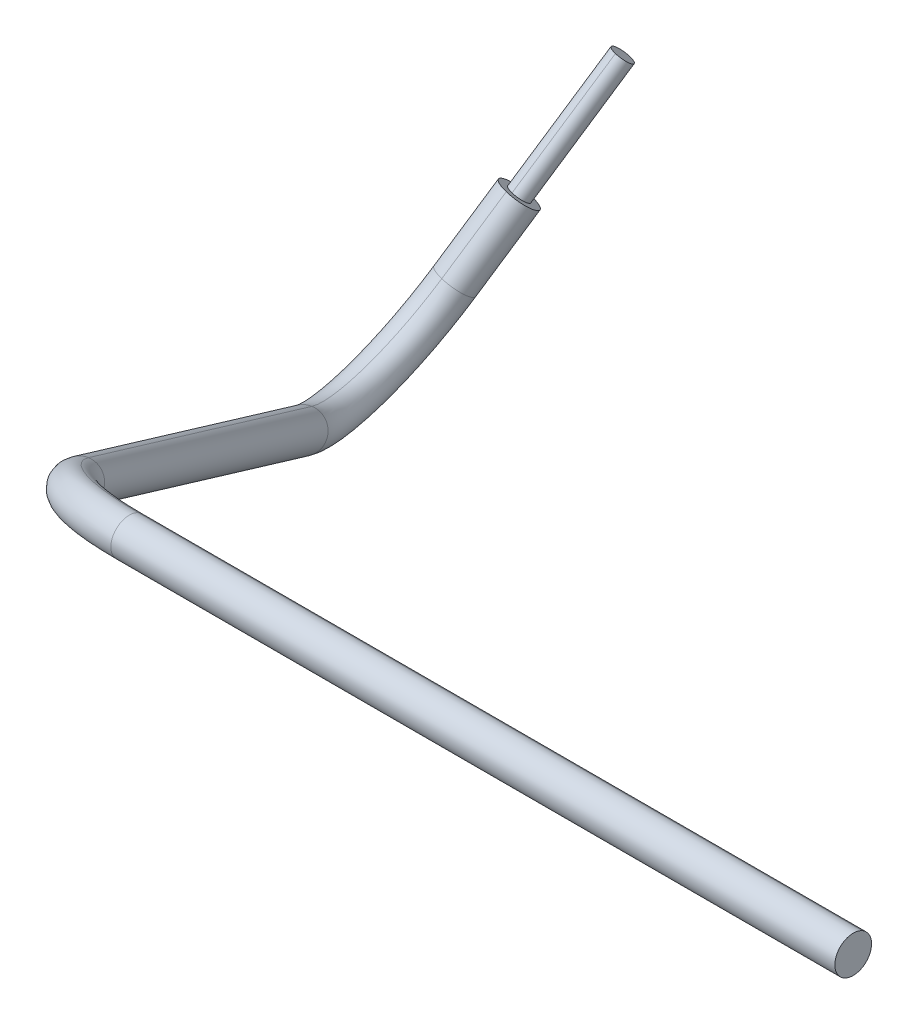
ISO-10303-21;
HEADER;
FILE_DESCRIPTION(('STEP AP214'),'2;1');
FILE_NAME('part.step','',(''),(''),'','','');
FILE_SCHEMA(('AUTOMOTIVE_DESIGN { 1 0 10303 214 1 1 1 1 }'));
ENDSEC;
DATA;
#1=APPLICATION_CONTEXT('core data for automotive mechanical design processes');
#2=APPLICATION_PROTOCOL_DEFINITION('international standard','automotive_design',2000,#1);
#3=PRODUCT_CONTEXT('',#1,'mechanical');
#4=PRODUCT('Part','Part','',(#3));
#5=PRODUCT_RELATED_PRODUCT_CATEGORY('part','',(#4));
#6=PRODUCT_DEFINITION_FORMATION('','',#4);
#7=PRODUCT_DEFINITION_CONTEXT('part definition',#1,'design');
#8=PRODUCT_DEFINITION('design','',#6,#7);
#9=PRODUCT_DEFINITION_SHAPE('','',#8);
#10=(LENGTH_UNIT() NAMED_UNIT(*) SI_UNIT(.MILLI.,.METRE.));
#11=(NAMED_UNIT(*) PLANE_ANGLE_UNIT() SI_UNIT($,.RADIAN.));
#12=(NAMED_UNIT(*) SI_UNIT($,.STERADIAN.) SOLID_ANGLE_UNIT());
#13=UNCERTAINTY_MEASURE_WITH_UNIT(LENGTH_MEASURE(1.E-05),#10,'distance_accuracy_value','');
#14=(GEOMETRIC_REPRESENTATION_CONTEXT(3) GLOBAL_UNCERTAINTY_ASSIGNED_CONTEXT((#13)) GLOBAL_UNIT_ASSIGNED_CONTEXT((#10,
#11,#12)) REPRESENTATION_CONTEXT('',''));
#15=CARTESIAN_POINT('',(0.,0.,0.));
#16=DIRECTION('',(0.,0.,1.));
#17=DIRECTION('',(1.,0.,0.));
#18=AXIS2_PLACEMENT_3D('',#15,#16,#17);
#19=CARTESIAN_POINT('',(-140.4669149487,-33.8291598666141,-101.131028985723));
#20=DIRECTION('',(0.230950995144067,0.776274779797275,-0.586565515601332));
#21=DIRECTION('',(-0.97256588869086,0.20146139609418,-0.116313791266306));
#22=AXIS2_PLACEMENT_3D('',#19,#20,#21);
#23=CYLINDRICAL_SURFACE('',#22,0.5);
#24=DIRECTION('',(-0.230950995144067,-0.776274779797275,0.586565515601332));
#25=VECTOR('',#24,1.);
#26=CARTESIAN_POINT('',(-140.5180856365,-34.1192287287071,-101.535060687362));
#27=LINE('',#26,#25);
#28=CARTESIAN_POINT('',(-139.8021375516,-31.7127769113196,-103.35341378568));
#29=VERTEX_POINT('',#28);
#30=CARTESIAN_POINT('',(-141.2340337215,-36.525680546088,-99.7167075889324));
#31=VERTEX_POINT('',#30);
#32=EDGE_CURVE('E11',#29,#31,#27,.T.);
#33=ORIENTED_EDGE('',*,*,#32,.T.);
#34=CARTESIAN_POINT('',(-141.1828630336,-36.235611683943,-99.3126758873235));
#35=DIRECTION('',(0.230950995144067,0.776274779797275,-0.586565515601332));
#36=DIRECTION('',(-0.857039245995224,0.447698345336645,0.255048862782739));
#37=AXIS2_PLACEMENT_3D('',#34,#35,#36);
#38=CIRCLE('',#37,0.5);
#39=CARTESIAN_POINT('',(-141.1316923457,-35.945542821798,-98.9086441857147));
#40=VERTEX_POINT('',#39);
#41=EDGE_CURVE('E27',#31,#40,#38,.T.);
#42=ORIENTED_EDGE('',*,*,#41,.T.);
#43=DIRECTION('',(-0.230950995144067,-0.776274779797275,0.586565515601332));
#44=VECTOR('',#43,1.);
#45=CARTESIAN_POINT('',(-140.4157442608,-33.5390910044345,-100.726997284135));
#46=LINE('',#45,#44);
#47=CARTESIAN_POINT('',(-139.6997961758,-31.132639187047,-102.545350382453));
#48=VERTEX_POINT('',#47);
#49=EDGE_CURVE('E180',#48,#40,#46,.T.);
#50=ORIENTED_EDGE('',*,*,#49,.F.);
#51=CARTESIAN_POINT('',(-139.7509668637,-31.4227080492266,-102.949382084042));
#52=DIRECTION('',(0.230950995144067,0.776274779797275,-0.586565515601332));
#53=DIRECTION('',(-0.857039245995224,0.447698345336645,0.255048862782739));
#54=AXIS2_PLACEMENT_3D('',#51,#52,#53);
#55=CIRCLE('',#54,0.5);
#56=EDGE_CURVE('E176',#29,#48,#55,.T.);
#57=ORIENTED_EDGE('',*,*,#56,.F.);
#58=EDGE_LOOP('',(#33,#42,#50,#57));
#59=FACE_BOUND('',#58,.T.);
#60=ADVANCED_FACE('F17',(#59),#23,.T.);
#61=CARTESIAN_POINT('',(-140.4669149487,-33.8291598666141,-101.131028985723));
#62=DIRECTION('',(0.230950995144067,0.776274779797275,-0.586565515601332));
#63=DIRECTION('',(-0.97256588869086,0.20146139609418,-0.116313791266306));
#64=AXIS2_PLACEMENT_3D('',#61,#62,#63);
#65=CYLINDRICAL_SURFACE('',#64,0.5);
#66=ORIENTED_EDGE('',*,*,#49,.T.);
#67=CARTESIAN_POINT('',(-141.1828630336,-36.235611683943,-99.3126758873235));
#68=DIRECTION('',(0.230950995144067,0.776274779797275,-0.586565515601332));
#69=DIRECTION('',(-0.857039245995224,0.447698345336645,0.255048862782739));
#70=AXIS2_PLACEMENT_3D('',#67,#68,#69);
#71=CIRCLE('',#70,0.5);
#72=EDGE_CURVE('E177',#40,#31,#71,.T.);
#73=ORIENTED_EDGE('',*,*,#72,.T.);
#74=ORIENTED_EDGE('',*,*,#32,.F.);
#75=CARTESIAN_POINT('',(-139.7509668637,-31.4227080492266,-102.949382084042));
#76=DIRECTION('',(0.230950995144067,0.776274779797275,-0.586565515601332));
#77=DIRECTION('',(-0.857039245995224,0.447698345336645,0.255048862782739));
#78=AXIS2_PLACEMENT_3D('',#75,#76,#77);
#79=CIRCLE('',#78,0.5);
#80=EDGE_CURVE('E173',#48,#29,#79,.T.);
#81=ORIENTED_EDGE('',*,*,#80,.F.);
#82=EDGE_LOOP('',(#66,#73,#74,#81));
#83=FACE_BOUND('',#82,.T.);
#84=ADVANCED_FACE('F190',(#83),#65,.T.);
#85=CARTESIAN_POINT('',(-88.0553859815001,-20.1443490061517,-67.6690067781521));
#86=DIRECTION('',(0.230950995144067,0.776274779797275,-0.586565515601332));
#87=DIRECTION('',(1.71982005971951E-13,0.60286370454622,0.797844191393789));
#88=AXIS2_PLACEMENT_3D('',#85,#86,#87);
#89=PLANE('',#88);
#90=ORIENTED_EDGE('',*,*,#56,.T.);
#91=ORIENTED_EDGE('',*,*,#80,.T.);
#92=EDGE_LOOP('',(#90,#91));
#93=FACE_BOUND('',#92,.T.);
#94=ADVANCED_FACE('F192',(#93),#89,.T.);
#95=CARTESIAN_POINT('',(-141.1828630336,-36.235611683943,-99.3126758873235));
#96=DIRECTION('',(0.230950995144067,0.776274779797275,-0.586565515601332));
#97=DIRECTION('',(-0.102341375739045,-0.580137724304706,-0.80806340323665));
#98=AXIS2_PLACEMENT_3D('',#95,#96,#97);
#99=PLANE('',#98);
#100=CARTESIAN_POINT('',(-141.1828630336,-36.235611683943,-99.3126758873235));
#101=DIRECTION('',(0.230950995144067,0.776274779797275,-0.586565515601332));
#102=DIRECTION('',(-0.857039245995226,0.447698345336643,0.255048862782736));
#103=AXIS2_PLACEMENT_3D('',#100,#101,#102);
#104=CIRCLE('',#103,0.9);
#105=CARTESIAN_POINT('',(-141.0907557954,-35.7134877320703,-98.5854188244113));
#106=VERTEX_POINT('',#105);
#107=CARTESIAN_POINT('',(-141.2749702718,-36.7577356358158,-100.039932950236));
#108=VERTEX_POINT('',#107);
#109=EDGE_CURVE('E143',#106,#108,#104,.T.);
#110=ORIENTED_EDGE('',*,*,#109,.T.);
#111=CARTESIAN_POINT('',(-141.1828630336,-36.235611683943,-99.3126758873235));
#112=DIRECTION('',(0.230950995144067,0.776274779797275,-0.586565515601332));
#113=DIRECTION('',(-0.857039245995226,0.447698345336643,0.255048862782736));
#114=AXIS2_PLACEMENT_3D('',#111,#112,#113);
#115=CIRCLE('',#114,0.9);
#116=EDGE_CURVE('E169',#108,#106,#115,.T.);
#117=ORIENTED_EDGE('',*,*,#116,.T.);
#118=EDGE_LOOP('',(#110,#117));
#119=FACE_BOUND('',#118,.T.);
#120=ORIENTED_EDGE('',*,*,#41,.F.);
#121=ORIENTED_EDGE('',*,*,#72,.F.);
#122=EDGE_LOOP('',(#120,#121));
#123=FACE_BOUND('',#122,.T.);
#124=ADVANCED_FACE('F188',(#119,#123),#99,.T.);
#125=CARTESIAN_POINT('',(-104.25,-25.,-64.));
#126=DIRECTION('',(-1.,0.,0.));
#127=DIRECTION('',(0.,-0.866025403784435,0.5));
#128=AXIS2_PLACEMENT_3D('',#125,#126,#127);
#129=CYLINDRICAL_SURFACE('',#128,0.9);
#130=DIRECTION('',(-1.,0.,0.));
#131=VECTOR('',#130,1.);
#132=CARTESIAN_POINT('',(-107.24423619,-24.2205771365941,-64.45));
#133=LINE('',#132,#131);
#134=CARTESIAN_POINT('',(-89.5,-24.2205771365941,-64.45));
#135=VERTEX_POINT('',#134);
#136=CARTESIAN_POINT('',(-119.,-24.2205771365941,-64.45));
#137=VERTEX_POINT('',#136);
#138=EDGE_CURVE('E149',#135,#137,#133,.T.);
#139=ORIENTED_EDGE('',*,*,#138,.F.);
#140=CARTESIAN_POINT('',(-89.5,-25.,-64.));
#141=DIRECTION('',(-1.,0.,0.));
#142=DIRECTION('',(0.,0.866025403784436,-0.500000000000006));
#143=AXIS2_PLACEMENT_3D('',#140,#141,#142);
#144=CIRCLE('',#143,0.9);
#145=CARTESIAN_POINT('',(-89.5,-25.7794228634061,-63.55));
#146=VERTEX_POINT('',#145);
#147=EDGE_CURVE('E165',#135,#146,#144,.T.);
#148=ORIENTED_EDGE('',*,*,#147,.T.);
#149=DIRECTION('',(1.,0.,0.));
#150=VECTOR('',#149,1.);
#151=CARTESIAN_POINT('',(-107.24423619,-25.7794228634061,-63.55));
#152=LINE('',#151,#150);
#153=CARTESIAN_POINT('',(-119.,-25.7794228634061,-63.55));
#154=VERTEX_POINT('',#153);
#155=EDGE_CURVE('E158',#154,#146,#152,.T.);
#156=ORIENTED_EDGE('',*,*,#155,.F.);
#157=DIRECTION('',(-1.,0.,0.));
#158=VECTOR('',#157,1.);
#159=CARTESIAN_POINT('',(-107.24423619,-25.7794228634061,-63.55));
#160=LINE('',#159,#158);
#161=CARTESIAN_POINT('',(-124.98847238,-25.7794228634061,-63.55));
#162=VERTEX_POINT('',#161);
#163=EDGE_CURVE('E161',#154,#162,#160,.T.);
#164=ORIENTED_EDGE('',*,*,#163,.T.);
#165=CARTESIAN_POINT('',(-124.98847238,-25.,-64.));
#166=DIRECTION('',(-1.,0.,0.));
#167=DIRECTION('',(0.,0.866025403784436,-0.500000000000006));
#168=AXIS2_PLACEMENT_3D('',#165,#166,#167);
#169=CIRCLE('',#168,0.9);
#170=CARTESIAN_POINT('',(-124.98847238,-24.2205771365941,-64.45));
#171=VERTEX_POINT('',#170);
#172=EDGE_CURVE('E118',#171,#162,#169,.T.);
#173=ORIENTED_EDGE('',*,*,#172,.F.);
#174=DIRECTION('',(1.,0.,0.));
#175=VECTOR('',#174,1.);
#176=CARTESIAN_POINT('',(-107.24423619,-24.2205771365941,-64.45));
#177=LINE('',#176,#175);
#178=EDGE_CURVE('E159',#171,#137,#177,.T.);
#179=ORIENTED_EDGE('',*,*,#178,.T.);
#180=EDGE_LOOP('',(#139,#148,#156,#164,#173,#179));
#181=FACE_BOUND('',#180,.T.);
#182=ADVANCED_FACE('F200',(#181),#129,.T.);
#183=CARTESIAN_POINT('',(-104.25,-25.,-64.));
#184=DIRECTION('',(-1.,0.,0.));
#185=DIRECTION('',(0.,-0.866025403784435,0.5));
#186=AXIS2_PLACEMENT_3D('',#183,#184,#185);
#187=CYLINDRICAL_SURFACE('',#186,0.9);
#188=ORIENTED_EDGE('',*,*,#155,.T.);
#189=CARTESIAN_POINT('',(-89.5,-25.,-64.));
#190=DIRECTION('',(-1.,0.,0.));
#191=DIRECTION('',(0.,0.866025403784436,-0.500000000000006));
#192=AXIS2_PLACEMENT_3D('',#189,#190,#191);
#193=CIRCLE('',#192,0.9);
#194=EDGE_CURVE('E155',#146,#135,#193,.T.);
#195=ORIENTED_EDGE('',*,*,#194,.T.);
#196=ORIENTED_EDGE('',*,*,#138,.T.);
#197=ORIENTED_EDGE('',*,*,#178,.F.);
#198=CARTESIAN_POINT('',(-124.98847238,-25.,-64.));
#199=DIRECTION('',(-1.,0.,0.));
#200=DIRECTION('',(0.,0.866025403784436,-0.500000000000006));
#201=AXIS2_PLACEMENT_3D('',#198,#199,#200);
#202=CIRCLE('',#201,0.9);
#203=EDGE_CURVE('E97',#162,#171,#202,.T.);
#204=ORIENTED_EDGE('',*,*,#203,.F.);
#205=ORIENTED_EDGE('',*,*,#163,.F.);
#206=EDGE_LOOP('',(#188,#195,#196,#197,#204,#205));
#207=FACE_BOUND('',#206,.T.);
#208=ADVANCED_FACE('F239',(#207),#187,.T.);
#209=CARTESIAN_POINT('',(-89.5,-25.,-64.));
#210=DIRECTION('',(-1.,0.,0.));
#211=DIRECTION('',(0.,-0.866025403784439,0.5));
#212=AXIS2_PLACEMENT_3D('',#209,#210,#211);
#213=PLANE('',#212);
#214=ORIENTED_EDGE('',*,*,#194,.F.);
#215=ORIENTED_EDGE('',*,*,#147,.F.);
#216=EDGE_LOOP('',(#214,#215));
#217=FACE_BOUND('',#216,.T.);
#218=ADVANCED_FACE('F250',(#217),#213,.F.);
#219=CARTESIAN_POINT('',(-141.629573538,-37.7370994702294,-98.1781279406356));
#220=DIRECTION('',(0.230950995144067,0.776274779797275,-0.586565515601332));
#221=DIRECTION('',(-0.97256588869086,0.201461396094187,-0.116313791266296));
#222=AXIS2_PLACEMENT_3D('',#219,#220,#221);
#223=CYLINDRICAL_SURFACE('',#222,0.9);
#224=DIRECTION('',(-0.230950995144067,-0.776274779797275,0.586565515601332));
#225=VECTOR('',#224,1.);
#226=CARTESIAN_POINT('',(-141.7216807762,-38.2592234221022,-98.9053850035478));
#227=LINE('',#226,#225);
#228=CARTESIAN_POINT('',(-142.1683912806,-39.7607112083299,-97.7708370567784));
#229=VERTEX_POINT('',#228);
#230=EDGE_CURVE('E147',#108,#229,#227,.T.);
#231=ORIENTED_EDGE('',*,*,#230,.T.);
#232=CARTESIAN_POINT('',(-142.0762840424,-39.2385872564571,-97.0435799938661));
#233=DIRECTION('',(0.230950995144067,0.776274779797275,-0.586565515601332));
#234=DIRECTION('',(-0.857039245995226,0.447698345336643,0.255048862782736));
#235=AXIS2_PLACEMENT_3D('',#232,#233,#234);
#236=CIRCLE('',#235,0.9);
#237=CARTESIAN_POINT('',(-141.9841768042,-38.7164633045844,-96.3163229309539));
#238=VERTEX_POINT('',#237);
#239=EDGE_CURVE('E134',#229,#238,#236,.T.);
#240=ORIENTED_EDGE('',*,*,#239,.T.);
#241=DIRECTION('',(-0.230950995144067,-0.776274779797275,0.586565515601332));
#242=VECTOR('',#241,1.);
#243=CARTESIAN_POINT('',(-141.5374662998,-37.214975518348,-97.4508708777284));
#244=LINE('',#243,#242);
#245=EDGE_CURVE('E99',#106,#238,#244,.T.);
#246=ORIENTED_EDGE('',*,*,#245,.F.);
#247=ORIENTED_EDGE('',*,*,#116,.F.);
#248=EDGE_LOOP('',(#231,#240,#246,#247));
#249=FACE_BOUND('',#248,.T.);
#250=ADVANCED_FACE('F146',(#249),#223,.T.);
#251=CARTESIAN_POINT('',(-139.8128380185,-36.3330133901466,-92.307077845292));
#252=DIRECTION('',(-0.896856099246292,0.403593211462475,0.181001814648727));
#253=DIRECTION('',(0.377241003984007,0.484262311058509,0.789417024772972));
#254=AXIS2_PLACEMENT_3D('',#251,#252,#253);
#255=TOROIDAL_SURFACE('',#254,6.,0.9);
#256=CARTESIAN_POINT('',(-141.1491337817,-40.9265574532114,-88.6857981579666));
#257=DIRECTION('',(-0.382160618280918,-0.500982469429405,-0.776511318114271));
#258=DIRECTION('',(-0.0174476937738369,0.844054959868547,-0.535972763023719));
#259=AXIS2_PLACEMENT_3D('',#256,#257,#258);
#260=CIRCLE('',#259,0.9);
#261=CARTESIAN_POINT('',(-141.108086684,-41.6911022510084,-88.2127374980735));
#262=VERTEX_POINT('',#261);
#263=CARTESIAN_POINT('',(-141.1901808794,-40.1620126554153,-89.1588588178593));
#264=VERTEX_POINT('',#263);
#265=EDGE_CURVE('E136',#262,#264,#260,.T.);
#266=ORIENTED_EDGE('',*,*,#265,.T.);
#267=CARTESIAN_POINT('',(-140.045799612,-36.2281786035971,-92.2600619736475));
#268=DIRECTION('',(-0.896856099246292,0.403593211462475,0.181001814648727));
#269=DIRECTION('',(0.240512927451466,0.788392787197326,-0.566206980550361));
#270=AXIS2_PLACEMENT_3D('',#267,#268,#269);
#271=CIRCLE('',#270,5.13829931456);
#272=EDGE_CURVE('E116',#238,#264,#271,.T.);
#273=ORIENTED_EDGE('',*,*,#272,.F.);
#274=ORIENTED_EDGE('',*,*,#239,.F.);
#275=CARTESIAN_POINT('',(-139.5798764249,-36.4378481766376,-92.3540937168549));
#276=DIRECTION('',(-0.896856099246292,0.403593211462475,0.181001814648727));
#277=DIRECTION('',(0.240512927451467,0.788392787197327,-0.56620698055036));
#278=AXIS2_PLACEMENT_3D('',#275,#276,#277);
#279=CIRCLE('',#278,6.86170068544);
#280=EDGE_CURVE('E114',#229,#262,#279,.T.);
#281=ORIENTED_EDGE('',*,*,#280,.T.);
#282=EDGE_LOOP('',(#266,#273,#274,#281));
#283=FACE_BOUND('',#282,.T.);
#284=ADVANCED_FACE('F132',(#283),#255,.T.);
#285=CARTESIAN_POINT('',(-135.8410908286,-33.9681312332553,-77.9003973789533));
#286=DIRECTION('',(-0.382160618280918,-0.500982469429405,-0.776511318114271));
#287=DIRECTION('',(0.923931187814937,-0.191279350808496,-0.331305554039107));
#288=AXIS2_PLACEMENT_3D('',#285,#286,#287);
#289=CYLINDRICAL_SURFACE('',#288,0.9);
#290=CARTESIAN_POINT('',(-130.5330478755,-27.0097050132711,-67.114996599887));
#291=DIRECTION('',(-0.382160618280918,-0.500982469429405,-0.776511318114271));
#292=DIRECTION('',(-0.0174476937738375,0.844054959868547,-0.535972763023719));
#293=AXIS2_PLACEMENT_3D('',#290,#291,#292);
#294=CIRCLE('',#293,0.9);
#295=CARTESIAN_POINT('',(-130.4920007778,-27.7742498110714,-66.6419359400035));
#296=VERTEX_POINT('',#295);
#297=CARTESIAN_POINT('',(-130.5740949732,-26.2451602154767,-67.5880572597787));
#298=VERTEX_POINT('',#297);
#299=EDGE_CURVE('E94',#296,#298,#294,.T.);
#300=ORIENTED_EDGE('',*,*,#299,.T.);
#301=DIRECTION('',(-0.382160618280918,-0.500982469429405,-0.776511318114271));
#302=VECTOR('',#301,1.);
#303=CARTESIAN_POINT('',(-135.8821379263,-33.2035864354611,-78.3734580388448));
#304=LINE('',#303,#302);
#305=EDGE_CURVE('E104',#298,#264,#304,.T.);
#306=ORIENTED_EDGE('',*,*,#305,.T.);
#307=ORIENTED_EDGE('',*,*,#265,.F.);
#308=DIRECTION('',(-0.382160618280918,-0.500982469429405,-0.776511318114271));
#309=VECTOR('',#308,1.);
#310=CARTESIAN_POINT('',(-135.8000437309,-34.7326760310481,-77.4273367190627));
#311=LINE('',#310,#309);
#312=EDGE_CURVE('E113',#296,#262,#311,.T.);
#313=ORIENTED_EDGE('',*,*,#312,.F.);
#314=EDGE_LOOP('',(#300,#306,#307,#313));
#315=FACE_BOUND('',#314,.T.);
#316=ADVANCED_FACE('F112',(#315),#289,.T.);
#317=CARTESIAN_POINT('',(-124.98847238,-28.2527952615817,-69.0417579261864));
#318=DIRECTION('',(0.,0.840292987697383,-0.542132543596681));
#319=DIRECTION('',(0.924095915928318,-0.207181708050937,-0.321126887715277));
#320=AXIS2_PLACEMENT_3D('',#317,#318,#319);
#321=TOROIDAL_SURFACE('',#320,6.,0.9);
#322=ORIENTED_EDGE('',*,*,#203,.T.);
#323=CARTESIAN_POINT('',(-124.98847238,-27.4974531966001,-69.5290826105162));
#324=DIRECTION('',(0.,-0.840292987697383,0.542132543596681));
#325=DIRECTION('',(0.,0.542132543596681,0.840292987697383));
#326=AXIS2_PLACEMENT_3D('',#323,#324,#325);
#327=CIRCLE('',#326,6.04441865501);
#328=EDGE_CURVE('E90',#171,#298,#327,.T.);
#329=ORIENTED_EDGE('',*,*,#328,.T.);
#330=ORIENTED_EDGE('',*,*,#299,.F.);
#331=CARTESIAN_POINT('',(-124.98847238,-29.0081373265616,-68.5544332418576));
#332=DIRECTION('',(0.,-0.840292987697383,0.542132543596681));
#333=DIRECTION('',(0.,0.542132543596681,0.840292987697383));
#334=AXIS2_PLACEMENT_3D('',#331,#332,#333);
#335=CIRCLE('',#334,5.95558134499);
#336=EDGE_CURVE('E83',#162,#296,#335,.T.);
#337=ORIENTED_EDGE('',*,*,#336,.F.);
#338=EDGE_LOOP('',(#322,#329,#330,#337));
#339=FACE_BOUND('',#338,.T.);
#340=ADVANCED_FACE('F92',(#339),#321,.T.);
#341=CARTESIAN_POINT('',(-141.629573538,-37.7370994702294,-98.1781279406356));
#342=DIRECTION('',(0.230950995144067,0.776274779797275,-0.586565515601332));
#343=DIRECTION('',(-0.97256588869086,0.201461396094187,-0.116313791266296));
#344=AXIS2_PLACEMENT_3D('',#341,#342,#343);
#345=CYLINDRICAL_SURFACE('',#344,0.9);
#346=ORIENTED_EDGE('',*,*,#245,.T.);
#347=CARTESIAN_POINT('',(-142.0762840424,-39.2385872564571,-97.0435799938661));
#348=DIRECTION('',(0.230950995144067,0.776274779797275,-0.586565515601332));
#349=DIRECTION('',(-0.857039245995226,0.447698345336643,0.255048862782736));
#350=AXIS2_PLACEMENT_3D('',#347,#348,#349);
#351=CIRCLE('',#350,0.9);
#352=EDGE_CURVE('E124',#238,#229,#351,.T.);
#353=ORIENTED_EDGE('',*,*,#352,.T.);
#354=ORIENTED_EDGE('',*,*,#230,.F.);
#355=ORIENTED_EDGE('',*,*,#109,.F.);
#356=EDGE_LOOP('',(#346,#353,#354,#355));
#357=FACE_BOUND('',#356,.T.);
#358=ADVANCED_FACE('F140',(#357),#345,.T.);
#359=CARTESIAN_POINT('',(-139.8128380185,-36.3330133901466,-92.307077845292));
#360=DIRECTION('',(-0.896856099246292,0.403593211462475,0.181001814648727));
#361=DIRECTION('',(0.377241003984007,0.484262311058509,0.789417024772972));
#362=AXIS2_PLACEMENT_3D('',#359,#360,#361);
#363=TOROIDAL_SURFACE('',#362,6.,0.9);
#364=CARTESIAN_POINT('',(-141.1491337817,-40.9265574532114,-88.6857981579666));
#365=DIRECTION('',(-0.382160618280918,-0.500982469429405,-0.776511318114271));
#366=DIRECTION('',(-0.0174476937738369,0.844054959868547,-0.535972763023719));
#367=AXIS2_PLACEMENT_3D('',#364,#365,#366);
#368=CIRCLE('',#367,0.9);
#369=EDGE_CURVE('E107',#264,#262,#368,.T.);
#370=ORIENTED_EDGE('',*,*,#369,.T.);
#371=ORIENTED_EDGE('',*,*,#280,.F.);
#372=ORIENTED_EDGE('',*,*,#352,.F.);
#373=ORIENTED_EDGE('',*,*,#272,.T.);
#374=EDGE_LOOP('',(#370,#371,#372,#373));
#375=FACE_BOUND('',#374,.T.);
#376=ADVANCED_FACE('F127',(#375),#363,.T.);
#377=CARTESIAN_POINT('',(-135.8410908286,-33.9681312332553,-77.9003973789533));
#378=DIRECTION('',(-0.382160618280918,-0.500982469429405,-0.776511318114271));
#379=DIRECTION('',(0.923931187814937,-0.191279350808496,-0.331305554039107));
#380=AXIS2_PLACEMENT_3D('',#377,#378,#379);
#381=CYLINDRICAL_SURFACE('',#380,0.9);
#382=CARTESIAN_POINT('',(-130.5330478755,-27.0097050132711,-67.114996599887));
#383=DIRECTION('',(-0.382160618280918,-0.500982469429405,-0.776511318114271));
#384=DIRECTION('',(-0.0174476937738375,0.844054959868547,-0.535972763023719));
#385=AXIS2_PLACEMENT_3D('',#382,#383,#384);
#386=CIRCLE('',#385,0.9);
#387=EDGE_CURVE('E21',#298,#296,#386,.T.);
#388=ORIENTED_EDGE('',*,*,#387,.T.);
#389=ORIENTED_EDGE('',*,*,#312,.T.);
#390=ORIENTED_EDGE('',*,*,#369,.F.);
#391=ORIENTED_EDGE('',*,*,#305,.F.);
#392=EDGE_LOOP('',(#388,#389,#390,#391));
#393=FACE_BOUND('',#392,.T.);
#394=ADVANCED_FACE('F105',(#393),#381,.T.);
#395=CARTESIAN_POINT('',(-124.98847238,-28.2527952615817,-69.0417579261864));
#396=DIRECTION('',(0.,0.840292987697383,-0.542132543596681));
#397=DIRECTION('',(0.924095915928318,-0.207181708050937,-0.321126887715277));
#398=AXIS2_PLACEMENT_3D('',#395,#396,#397);
#399=TOROIDAL_SURFACE('',#398,6.,0.9);
#400=ORIENTED_EDGE('',*,*,#172,.T.);
#401=ORIENTED_EDGE('',*,*,#336,.T.);
#402=ORIENTED_EDGE('',*,*,#387,.F.);
#403=ORIENTED_EDGE('',*,*,#328,.F.);
#404=EDGE_LOOP('',(#400,#401,#402,#403));
#405=FACE_BOUND('',#404,.T.);
#406=ADVANCED_FACE('F19',(#405),#399,.T.);
#407=CLOSED_SHELL('',(#60,#84,#94,#124,#182,#208,#218,#250,#284,#316,#340,#358,#376,#394,#406));
#408=MANIFOLD_SOLID_BREP('B1',#407);
#409=ADVANCED_BREP_SHAPE_REPRESENTATION('',(#18,#408),#14);
#410=SHAPE_DEFINITION_REPRESENTATION(#9,#409);
ENDSEC;
END-ISO-10303-21;
